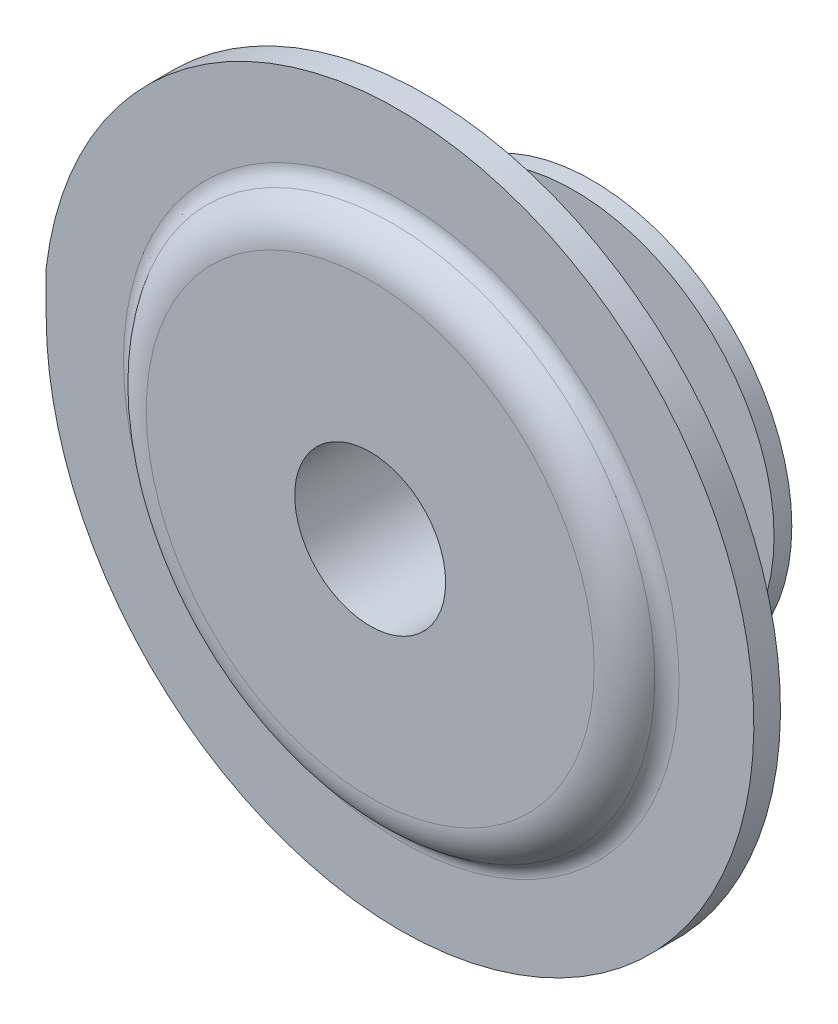
ISO-10303-21;
HEADER;
FILE_DESCRIPTION(('STEP AP214'),'2;1');
FILE_NAME('part.step','',(''),(''),'','','');
FILE_SCHEMA(('AUTOMOTIVE_DESIGN { 1 0 10303 214 1 1 1 1 }'));
ENDSEC;
DATA;
#1=APPLICATION_CONTEXT('core data for automotive mechanical design processes');
#2=APPLICATION_PROTOCOL_DEFINITION('international standard','automotive_design',2000,#1);
#3=PRODUCT_CONTEXT('',#1,'mechanical');
#4=PRODUCT('Part','Part','',(#3));
#5=PRODUCT_RELATED_PRODUCT_CATEGORY('part','',(#4));
#6=PRODUCT_DEFINITION_FORMATION('','',#4);
#7=PRODUCT_DEFINITION_CONTEXT('part definition',#1,'design');
#8=PRODUCT_DEFINITION('design','',#6,#7);
#9=PRODUCT_DEFINITION_SHAPE('','',#8);
#10=(LENGTH_UNIT() NAMED_UNIT(*) SI_UNIT(.MILLI.,.METRE.));
#11=(NAMED_UNIT(*) PLANE_ANGLE_UNIT() SI_UNIT($,.RADIAN.));
#12=(NAMED_UNIT(*) SI_UNIT($,.STERADIAN.) SOLID_ANGLE_UNIT());
#13=UNCERTAINTY_MEASURE_WITH_UNIT(LENGTH_MEASURE(1.E-05),#10,'distance_accuracy_value','');
#14=(GEOMETRIC_REPRESENTATION_CONTEXT(3) GLOBAL_UNCERTAINTY_ASSIGNED_CONTEXT((#13)) GLOBAL_UNIT_ASSIGNED_CONTEXT((#10,
#11,#12)) REPRESENTATION_CONTEXT('',''));
#15=CARTESIAN_POINT('',(0.,0.,0.));
#16=DIRECTION('',(0.,0.,1.));
#17=DIRECTION('',(1.,0.,0.));
#18=AXIS2_PLACEMENT_3D('',#15,#16,#17);
#19=CARTESIAN_POINT('',(0.,0.,0.15));
#20=DIRECTION('',(0.,0.,1.));
#21=DIRECTION('',(1.,0.,0.));
#22=AXIS2_PLACEMENT_3D('',#19,#20,#21);
#23=PLANE('',#22);
#24=CARTESIAN_POINT('',(0.,-12.,0.15));
#25=DIRECTION('',(0.,0.,1.));
#26=DIRECTION('',(1.,0.,0.));
#27=AXIS2_PLACEMENT_3D('',#24,#25,#26);
#28=CIRCLE('',#27,3.12924818194063);
#29=CARTESIAN_POINT('',(3.12924818194063,-12.,0.15));
#30=VERTEX_POINT('',#29);
#31=EDGE_CURVE('E91',#30,#30,#28,.F.);
#32=ORIENTED_EDGE('',*,*,#31,.T.);
#33=EDGE_LOOP('',(#32));
#34=FACE_BOUND('',#33,.T.);
#35=CARTESIAN_POINT('',(0.,-12.,0.15));
#36=DIRECTION('',(0.,0.,1.));
#37=DIRECTION('',(1.,0.,0.));
#38=AXIS2_PLACEMENT_3D('',#35,#36,#37);
#39=CIRCLE('',#38,4.);
#40=CARTESIAN_POINT('',(-4.,-12.,0.15));
#41=VERTEX_POINT('',#40);
#42=CARTESIAN_POINT('',(-0.0138167397228893,-15.9999761371417,0.15));
#43=VERTEX_POINT('',#42);
#44=EDGE_CURVE('E80',#41,#43,#39,.T.);
#45=ORIENTED_EDGE('',*,*,#44,.T.);
#46=CARTESIAN_POINT('',(-0.0276334794457834,-12.,0.150000000000001));
#47=DIRECTION('',(0.,0.,1.));
#48=DIRECTION('',(1.,0.,0.));
#49=AXIS2_PLACEMENT_3D('',#46,#47,#48);
#50=CIRCLE('',#49,4.);
#51=CARTESIAN_POINT('',(-4.,-11.530634229646,0.150000000000001));
#52=VERTEX_POINT('',#51);
#53=EDGE_CURVE('E44',#43,#52,#50,.T.);
#54=ORIENTED_EDGE('',*,*,#53,.T.);
#55=DIRECTION('',(0.,-1.,0.));
#56=VECTOR('',#55,1.);
#57=CARTESIAN_POINT('',(-4.,0.,0.15));
#58=LINE('',#57,#56);
#59=EDGE_CURVE('E51',#52,#41,#58,.T.);
#60=ORIENTED_EDGE('',*,*,#59,.T.);
#61=EDGE_LOOP('',(#45,#54,#60));
#62=FACE_BOUND('',#61,.T.);
#63=ADVANCED_FACE('F30',(#34,#62),#23,.T.);
#64=CARTESIAN_POINT('',(0.,0.,-0.15));
#65=DIRECTION('',(0.,0.,1.));
#66=DIRECTION('',(1.,0.,0.));
#67=AXIS2_PLACEMENT_3D('',#64,#65,#66);
#68=PLANE('',#67);
#69=CARTESIAN_POINT('',(0.,-12.,-0.15));
#70=DIRECTION('',(0.,0.,1.));
#71=DIRECTION('',(1.,0.,0.));
#72=AXIS2_PLACEMENT_3D('',#69,#70,#71);
#73=CIRCLE('',#72,1.);
#74=CARTESIAN_POINT('',(1.,-12.,-0.15));
#75=VERTEX_POINT('',#74);
#76=EDGE_CURVE('E82',#75,#75,#73,.T.);
#77=ORIENTED_EDGE('',*,*,#76,.T.);
#78=EDGE_LOOP('',(#77));
#79=FACE_BOUND('',#78,.T.);
#80=CARTESIAN_POINT('',(-0.0276334794457834,-12.,-0.150000000000001));
#81=DIRECTION('',(0.,0.,1.));
#82=DIRECTION('',(1.,0.,0.));
#83=AXIS2_PLACEMENT_3D('',#80,#81,#82);
#84=CIRCLE('',#83,4.);
#85=CARTESIAN_POINT('',(-0.0138167397228893,-15.9999761371417,-0.15));
#86=VERTEX_POINT('',#85);
#87=CARTESIAN_POINT('',(-4.,-11.530634229646,-0.150000000000001));
#88=VERTEX_POINT('',#87);
#89=EDGE_CURVE('E64',#86,#88,#84,.T.);
#90=ORIENTED_EDGE('',*,*,#89,.F.);
#91=CARTESIAN_POINT('',(0.,-12.,-0.15));
#92=DIRECTION('',(0.,0.,1.));
#93=DIRECTION('',(1.,0.,0.));
#94=AXIS2_PLACEMENT_3D('',#91,#92,#93);
#95=CIRCLE('',#94,4.);
#96=CARTESIAN_POINT('',(-4.,-12.,-0.15));
#97=VERTEX_POINT('',#96);
#98=EDGE_CURVE('E73',#97,#86,#95,.T.);
#99=ORIENTED_EDGE('',*,*,#98,.F.);
#100=DIRECTION('',(0.,-1.,0.));
#101=VECTOR('',#100,1.);
#102=CARTESIAN_POINT('',(-4.,0.,-0.15));
#103=LINE('',#102,#101);
#104=EDGE_CURVE('E74',#88,#97,#103,.T.);
#105=ORIENTED_EDGE('',*,*,#104,.F.);
#106=EDGE_LOOP('',(#90,#99,#105));
#107=FACE_BOUND('',#106,.T.);
#108=ADVANCED_FACE('F72',(#79,#107),#68,.F.);
#109=CARTESIAN_POINT('',(-4.,0.,0.15));
#110=DIRECTION('',(1.,0.,0.));
#111=DIRECTION('',(0.,1.,0.));
#112=AXIS2_PLACEMENT_3D('',#109,#110,#111);
#113=PLANE('',#112);
#114=DIRECTION('',(0.,0.,1.));
#115=VECTOR('',#114,1.);
#116=CARTESIAN_POINT('',(-4.,-11.530634229646,-15.));
#117=LINE('',#116,#115);
#118=EDGE_CURVE('E112',#88,#52,#117,.T.);
#119=ORIENTED_EDGE('',*,*,#118,.F.);
#120=ORIENTED_EDGE('',*,*,#104,.T.);
#121=DIRECTION('',(0.,0.,-1.));
#122=VECTOR('',#121,1.);
#123=CARTESIAN_POINT('',(-4.,-12.,0.15));
#124=LINE('',#123,#122);
#125=EDGE_CURVE('E78',#41,#97,#124,.T.);
#126=ORIENTED_EDGE('',*,*,#125,.F.);
#127=ORIENTED_EDGE('',*,*,#59,.F.);
#128=EDGE_LOOP('',(#119,#120,#126,#127));
#129=FACE_BOUND('',#128,.T.);
#130=ADVANCED_FACE('F32',(#129),#113,.F.);
#131=CARTESIAN_POINT('',(0.,-12.,0.15));
#132=DIRECTION('',(0.,0.,-1.));
#133=DIRECTION('',(-1.,0.,0.));
#134=AXIS2_PLACEMENT_3D('',#131,#132,#133);
#135=CYLINDRICAL_SURFACE('',#134,4.);
#136=DIRECTION('',(0.,0.,1.));
#137=VECTOR('',#136,1.);
#138=CARTESIAN_POINT('',(-0.0138167397228917,-15.9999761371417,0.));
#139=LINE('',#138,#137);
#140=EDGE_CURVE('E11',#43,#86,#139,.F.);
#141=ORIENTED_EDGE('',*,*,#140,.F.);
#142=ORIENTED_EDGE('',*,*,#44,.F.);
#143=ORIENTED_EDGE('',*,*,#125,.T.);
#144=ORIENTED_EDGE('',*,*,#98,.T.);
#145=EDGE_LOOP('',(#141,#142,#143,#144));
#146=FACE_BOUND('',#145,.T.);
#147=ADVANCED_FACE('F77',(#146),#135,.T.);
#148=CARTESIAN_POINT('',(0.,-12.,-2.));
#149=DIRECTION('',(0.,0.,1.));
#150=DIRECTION('',(1.,0.,0.));
#151=AXIS2_PLACEMENT_3D('',#148,#149,#150);
#152=CYLINDRICAL_SURFACE('',#151,1.);
#153=ORIENTED_EDGE('',*,*,#76,.F.);
#154=EDGE_LOOP('',(#153));
#155=FACE_BOUND('',#154,.T.);
#156=CARTESIAN_POINT('',(0.,-12.,-1.8));
#157=DIRECTION('',(0.,0.,-1.));
#158=DIRECTION('',(-1.,0.,0.));
#159=AXIS2_PLACEMENT_3D('',#156,#157,#158);
#160=CIRCLE('',#159,1.);
#161=CARTESIAN_POINT('',(-1.,-12.,-1.8));
#162=VERTEX_POINT('',#161);
#163=EDGE_CURVE('E98',#162,#162,#160,.F.);
#164=ORIENTED_EDGE('',*,*,#163,.T.);
#165=EDGE_LOOP('',(#164));
#166=FACE_BOUND('',#165,.T.);
#167=ADVANCED_FACE('F132',(#155,#166),#152,.T.);
#168=CARTESIAN_POINT('',(0.,-12.,0.5));
#169=DIRECTION('',(0.,0.,1.));
#170=DIRECTION('',(1.,0.,0.));
#171=AXIS2_PLACEMENT_3D('',#168,#169,#170);
#172=PLANE('',#171);
#173=CARTESIAN_POINT('',(0.,-12.,0.5));
#174=DIRECTION('',(0.,0.,1.));
#175=DIRECTION('',(1.,0.,0.));
#176=AXIS2_PLACEMENT_3D('',#173,#174,#175);
#177=CIRCLE('',#176,0.85);
#178=CARTESIAN_POINT('',(0.85,-12.,0.5));
#179=VERTEX_POINT('',#178);
#180=EDGE_CURVE('E100',#179,#179,#177,.T.);
#181=ORIENTED_EDGE('',*,*,#180,.F.);
#182=EDGE_LOOP('',(#181));
#183=FACE_BOUND('',#182,.T.);
#184=CARTESIAN_POINT('',(0.,-12.,0.5));
#185=DIRECTION('',(0.,0.,1.));
#186=DIRECTION('',(1.,0.,0.));
#187=AXIS2_PLACEMENT_3D('',#184,#185,#186);
#188=CIRCLE('',#187,2.52303039929153);
#189=CARTESIAN_POINT('',(2.52303039929153,-12.,0.5));
#190=VERTEX_POINT('',#189);
#191=EDGE_CURVE('E88',#190,#190,#188,.T.);
#192=ORIENTED_EDGE('',*,*,#191,.T.);
#193=EDGE_LOOP('',(#192));
#194=FACE_BOUND('',#193,.T.);
#195=ADVANCED_FACE('F128',(#183,#194),#172,.T.);
#196=CARTESIAN_POINT('',(0.,-12.,0.));
#197=DIRECTION('',(0.,0.,-1.));
#198=DIRECTION('',(-1.,0.,0.));
#199=AXIS2_PLACEMENT_3D('',#196,#197,#198);
#200=TOROIDAL_SURFACE('',#199,2.52303039929153,0.5);
#201=CARTESIAN_POINT('',(0.,-12.,0.250000000000002));
#202=DIRECTION('',(0.,0.,-1.));
#203=DIRECTION('',(-1.,0.,0.));
#204=AXIS2_PLACEMENT_3D('',#201,#202,#203);
#205=CIRCLE('',#204,2.95604310118375);
#206=CARTESIAN_POINT('',(-2.95604310118375,-12.,0.250000000000002));
#207=VERTEX_POINT('',#206);
#208=EDGE_CURVE('E38',#207,#207,#205,.F.);
#209=ORIENTED_EDGE('',*,*,#208,.T.);
#210=EDGE_LOOP('',(#209));
#211=FACE_BOUND('',#210,.T.);
#212=ORIENTED_EDGE('',*,*,#191,.F.);
#213=EDGE_LOOP('',(#212));
#214=FACE_BOUND('',#213,.T.);
#215=ADVANCED_FACE('F131',(#211,#214),#200,.T.);
#216=CARTESIAN_POINT('',(0.,-12.,0.35));
#217=DIRECTION('',(0.,0.,1.));
#218=DIRECTION('',(1.,0.,0.));
#219=AXIS2_PLACEMENT_3D('',#216,#217,#218);
#220=TOROIDAL_SURFACE('',#219,3.12924818194063,0.2);
#221=ORIENTED_EDGE('',*,*,#208,.F.);
#222=EDGE_LOOP('',(#221));
#223=FACE_BOUND('',#222,.T.);
#224=ORIENTED_EDGE('',*,*,#31,.F.);
#225=EDGE_LOOP('',(#224));
#226=FACE_BOUND('',#225,.T.);
#227=ADVANCED_FACE('F137',(#223,#226),#220,.F.);
#228=CARTESIAN_POINT('',(0.,-12.,-2.));
#229=DIRECTION('',(0.,0.,1.));
#230=DIRECTION('',(1.,0.,0.));
#231=AXIS2_PLACEMENT_3D('',#228,#229,#230);
#232=PLANE('',#231);
#233=CARTESIAN_POINT('',(0.,-12.,-2.));
#234=DIRECTION('',(0.,0.,1.));
#235=DIRECTION('',(1.,0.,0.));
#236=AXIS2_PLACEMENT_3D('',#233,#234,#235);
#237=CIRCLE('',#236,0.85);
#238=CARTESIAN_POINT('',(0.85,-12.,-2.));
#239=VERTEX_POINT('',#238);
#240=EDGE_CURVE('E97',#239,#239,#237,.T.);
#241=ORIENTED_EDGE('',*,*,#240,.T.);
#242=EDGE_LOOP('',(#241));
#243=FACE_BOUND('',#242,.T.);
#244=CARTESIAN_POINT('',(0.,-12.,-2.));
#245=DIRECTION('',(0.,0.,-1.));
#246=DIRECTION('',(-1.,0.,0.));
#247=AXIS2_PLACEMENT_3D('',#244,#245,#246);
#248=CIRCLE('',#247,2.25);
#249=CARTESIAN_POINT('',(-2.25,-12.,-2.));
#250=VERTEX_POINT('',#249);
#251=EDGE_CURVE('E107',#250,#250,#248,.T.);
#252=ORIENTED_EDGE('',*,*,#251,.T.);
#253=EDGE_LOOP('',(#252));
#254=FACE_BOUND('',#253,.T.);
#255=ADVANCED_FACE('F118',(#243,#254),#232,.F.);
#256=CARTESIAN_POINT('',(0.,-12.,-2.));
#257=DIRECTION('',(0.,0.,1.));
#258=DIRECTION('',(1.,0.,0.));
#259=AXIS2_PLACEMENT_3D('',#256,#257,#258);
#260=CYLINDRICAL_SURFACE('',#259,0.85);
#261=ORIENTED_EDGE('',*,*,#240,.F.);
#262=EDGE_LOOP('',(#261));
#263=FACE_BOUND('',#262,.T.);
#264=ORIENTED_EDGE('',*,*,#180,.T.);
#265=EDGE_LOOP('',(#264));
#266=FACE_BOUND('',#265,.T.);
#267=ADVANCED_FACE('F121',(#263,#266),#260,.F.);
#268=CARTESIAN_POINT('',(0.,-12.,-1.8));
#269=DIRECTION('',(0.,0.,-1.));
#270=DIRECTION('',(-1.,0.,0.));
#271=AXIS2_PLACEMENT_3D('',#268,#269,#270);
#272=CYLINDRICAL_SURFACE('',#271,2.25);
#273=CARTESIAN_POINT('',(0.,-12.,-1.8));
#274=DIRECTION('',(0.,0.,-1.));
#275=DIRECTION('',(-1.,0.,0.));
#276=AXIS2_PLACEMENT_3D('',#273,#274,#275);
#277=CIRCLE('',#276,2.25);
#278=CARTESIAN_POINT('',(-2.25,-12.,-1.8));
#279=VERTEX_POINT('',#278);
#280=EDGE_CURVE('E101',#279,#279,#277,.T.);
#281=ORIENTED_EDGE('',*,*,#280,.T.);
#282=EDGE_LOOP('',(#281));
#283=FACE_BOUND('',#282,.T.);
#284=ORIENTED_EDGE('',*,*,#251,.F.);
#285=EDGE_LOOP('',(#284));
#286=FACE_BOUND('',#285,.T.);
#287=ADVANCED_FACE('F124',(#283,#286),#272,.T.);
#288=CARTESIAN_POINT('',(0.,-12.,-1.8));
#289=DIRECTION('',(0.,0.,-1.));
#290=DIRECTION('',(-1.,0.,0.));
#291=AXIS2_PLACEMENT_3D('',#288,#289,#290);
#292=PLANE('',#291);
#293=ORIENTED_EDGE('',*,*,#163,.F.);
#294=EDGE_LOOP('',(#293));
#295=FACE_BOUND('',#294,.T.);
#296=ORIENTED_EDGE('',*,*,#280,.F.);
#297=EDGE_LOOP('',(#296));
#298=FACE_BOUND('',#297,.T.);
#299=ADVANCED_FACE('F181',(#295,#298),#292,.F.);
#300=CARTESIAN_POINT('',(-0.0276334794457834,-12.,-15.));
#301=DIRECTION('',(0.,0.,1.));
#302=DIRECTION('',(1.,0.,0.));
#303=AXIS2_PLACEMENT_3D('',#300,#301,#302);
#304=CYLINDRICAL_SURFACE('',#303,4.);
#305=ORIENTED_EDGE('',*,*,#118,.T.);
#306=ORIENTED_EDGE('',*,*,#53,.F.);
#307=ORIENTED_EDGE('',*,*,#140,.T.);
#308=ORIENTED_EDGE('',*,*,#89,.T.);
#309=EDGE_LOOP('',(#305,#306,#307,#308));
#310=FACE_BOUND('',#309,.T.);
#311=ADVANCED_FACE('F63',(#310),#304,.T.);
#312=CLOSED_SHELL('',(#63,#108,#130,#147,#167,#195,#215,#227,#255,#267,#287,#299,#311));
#313=MANIFOLD_SOLID_BREP('B2',#312);
#314=ADVANCED_BREP_SHAPE_REPRESENTATION('',(#18,#313),#14);
#315=SHAPE_DEFINITION_REPRESENTATION(#9,#314);
ENDSEC;
END-ISO-10303-21;
